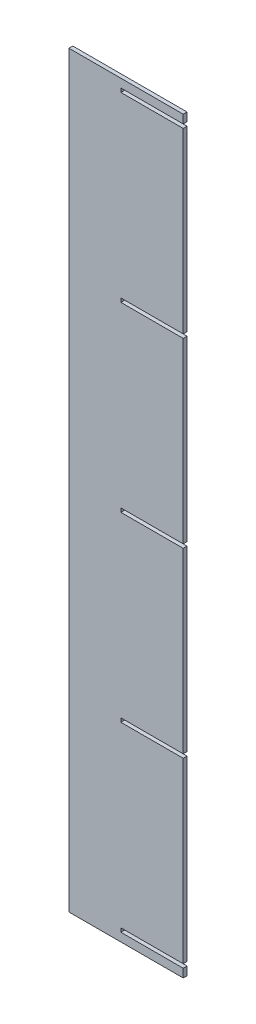
ISO-10303-21;
HEADER;
FILE_DESCRIPTION(('STEP AP214'),'2;1');
FILE_NAME('part.step','',(''),(''),'','','');
FILE_SCHEMA(('AUTOMOTIVE_DESIGN { 1 0 10303 214 1 1 1 1 }'));
ENDSEC;
DATA;
#1=APPLICATION_CONTEXT('core data for automotive mechanical design processes');
#2=APPLICATION_PROTOCOL_DEFINITION('international standard','automotive_design',2000,#1);
#3=PRODUCT_CONTEXT('',#1,'mechanical');
#4=PRODUCT('Part','Part','',(#3));
#5=PRODUCT_RELATED_PRODUCT_CATEGORY('part','',(#4));
#6=PRODUCT_DEFINITION_FORMATION('','',#4);
#7=PRODUCT_DEFINITION_CONTEXT('part definition',#1,'design');
#8=PRODUCT_DEFINITION('design','',#6,#7);
#9=PRODUCT_DEFINITION_SHAPE('','',#8);
#10=(LENGTH_UNIT() NAMED_UNIT(*) SI_UNIT(.MILLI.,.METRE.));
#11=(NAMED_UNIT(*) PLANE_ANGLE_UNIT() SI_UNIT($,.RADIAN.));
#12=(NAMED_UNIT(*) SI_UNIT($,.STERADIAN.) SOLID_ANGLE_UNIT());
#13=UNCERTAINTY_MEASURE_WITH_UNIT(LENGTH_MEASURE(1.E-05),#10,'distance_accuracy_value','');
#14=(GEOMETRIC_REPRESENTATION_CONTEXT(3) GLOBAL_UNCERTAINTY_ASSIGNED_CONTEXT((#13)) GLOBAL_UNIT_ASSIGNED_CONTEXT((#10,
#11,#12)) REPRESENTATION_CONTEXT('',''));
#15=CARTESIAN_POINT('',(0.,0.,0.));
#16=DIRECTION('',(0.,0.,1.));
#17=DIRECTION('',(1.,0.,0.));
#18=AXIS2_PLACEMENT_3D('',#15,#16,#17);
#19=CARTESIAN_POINT('',(25593.6209332168,0.,9.398));
#20=DIRECTION('',(1.,0.,0.));
#21=DIRECTION('',(0.,0.,-1.));
#22=AXIS2_PLACEMENT_3D('',#19,#20,#21);
#23=PLANE('',#22);
#24=DIRECTION('',(0.,-1.,0.));
#25=VECTOR('',#24,1.);
#26=CARTESIAN_POINT('',(25593.6209332168,0.,0.));
#27=LINE('',#26,#25);
#28=CARTESIAN_POINT('',(25593.6209332168,7030.05057188492,0.));
#29=VERTEX_POINT('',#28);
#30=CARTESIAN_POINT('',(25593.6209332168,7020.65257188492,0.));
#31=VERTEX_POINT('',#30);
#32=EDGE_CURVE('E284',#29,#31,#27,.T.);
#33=ORIENTED_EDGE('',*,*,#32,.F.);
#34=DIRECTION('',(0.,0.,-1.));
#35=VECTOR('',#34,1.);
#36=CARTESIAN_POINT('',(25593.6209332168,7030.05057188492,9.398));
#37=LINE('',#36,#35);
#38=CARTESIAN_POINT('',(25593.6209332168,7030.05057188492,9.398));
#39=VERTEX_POINT('',#38);
#40=EDGE_CURVE('E11',#39,#29,#37,.T.);
#41=ORIENTED_EDGE('',*,*,#40,.F.);
#42=DIRECTION('',(0.,-1.,0.));
#43=VECTOR('',#42,1.);
#44=CARTESIAN_POINT('',(25593.6209332168,0.,9.398));
#45=LINE('',#44,#43);
#46=CARTESIAN_POINT('',(25593.6209332168,7020.65257188492,9.398));
#47=VERTEX_POINT('',#46);
#48=EDGE_CURVE('E239',#39,#47,#45,.T.);
#49=ORIENTED_EDGE('',*,*,#48,.T.);
#50=DIRECTION('',(0.,0.,-1.));
#51=VECTOR('',#50,1.);
#52=CARTESIAN_POINT('',(25593.6209332168,7020.65257188492,9.398));
#53=LINE('',#52,#51);
#54=EDGE_CURVE('E51',#47,#31,#53,.T.);
#55=ORIENTED_EDGE('',*,*,#54,.T.);
#56=EDGE_LOOP('',(#33,#41,#49,#55));
#57=FACE_BOUND('',#56,.T.);
#58=ADVANCED_FACE('F35',(#57),#23,.T.);
#59=CARTESIAN_POINT('',(0.,7030.05057188492,9.398));
#60=DIRECTION('',(0.,-1.,0.));
#61=DIRECTION('',(0.,0.,-1.));
#62=AXIS2_PLACEMENT_3D('',#59,#60,#61);
#63=PLANE('',#62);
#64=DIRECTION('',(-1.,0.,0.));
#65=VECTOR('',#64,1.);
#66=CARTESIAN_POINT('',(0.,7030.05057188492,0.));
#67=LINE('',#66,#65);
#68=CARTESIAN_POINT('',(25746.0209332168,7030.05057188492,0.));
#69=VERTEX_POINT('',#68);
#70=EDGE_CURVE('E286',#69,#29,#67,.T.);
#71=ORIENTED_EDGE('',*,*,#70,.F.);
#72=DIRECTION('',(0.,0.,-1.));
#73=VECTOR('',#72,1.);
#74=CARTESIAN_POINT('',(25746.0209332168,7030.05057188492,9.398));
#75=LINE('',#74,#73);
#76=CARTESIAN_POINT('',(25746.0209332168,7030.05057188492,9.398));
#77=VERTEX_POINT('',#76);
#78=EDGE_CURVE('E43',#77,#69,#75,.T.);
#79=ORIENTED_EDGE('',*,*,#78,.F.);
#80=DIRECTION('',(-1.,0.,0.));
#81=VECTOR('',#80,1.);
#82=CARTESIAN_POINT('',(0.,7030.05057188492,9.398));
#83=LINE('',#82,#81);
#84=EDGE_CURVE('E230',#77,#39,#83,.T.);
#85=ORIENTED_EDGE('',*,*,#84,.T.);
#86=ORIENTED_EDGE('',*,*,#40,.T.);
#87=EDGE_LOOP('',(#71,#79,#85,#86));
#88=FACE_BOUND('',#87,.T.);
#89=ADVANCED_FACE('F389',(#88),#63,.T.);
#90=CARTESIAN_POINT('',(25746.0209332168,0.,9.398));
#91=DIRECTION('',(-1.,0.,0.));
#92=DIRECTION('',(0.,0.,1.));
#93=AXIS2_PLACEMENT_3D('',#90,#91,#92);
#94=PLANE('',#93);
#95=DIRECTION('',(0.,1.,0.));
#96=VECTOR('',#95,1.);
#97=CARTESIAN_POINT('',(25746.0209332168,0.,0.));
#98=LINE('',#97,#96);
#99=CARTESIAN_POINT('',(25746.0209332168,7465.15257188492,0.));
#100=VERTEX_POINT('',#99);
#101=EDGE_CURVE('E289',#69,#100,#98,.T.);
#102=ORIENTED_EDGE('',*,*,#101,.T.);
#103=DIRECTION('',(0.,0.,-1.));
#104=VECTOR('',#103,1.);
#105=CARTESIAN_POINT('',(25746.0209332168,7465.15257188492,9.398));
#106=LINE('',#105,#104);
#107=CARTESIAN_POINT('',(25746.0209332168,7465.15257188492,9.398));
#108=VERTEX_POINT('',#107);
#109=EDGE_CURVE('E380',#108,#100,#106,.T.);
#110=ORIENTED_EDGE('',*,*,#109,.F.);
#111=DIRECTION('',(0.,1.,0.));
#112=VECTOR('',#111,1.);
#113=CARTESIAN_POINT('',(25746.0209332168,0.,9.398));
#114=LINE('',#113,#112);
#115=EDGE_CURVE('E222',#77,#108,#114,.T.);
#116=ORIENTED_EDGE('',*,*,#115,.F.);
#117=ORIENTED_EDGE('',*,*,#78,.T.);
#118=EDGE_LOOP('',(#102,#110,#116,#117));
#119=FACE_BOUND('',#118,.T.);
#120=ADVANCED_FACE('F383',(#119),#94,.F.);
#121=CARTESIAN_POINT('',(0.,7465.15257188492,9.398));
#122=DIRECTION('',(0.,1.,0.));
#123=DIRECTION('',(0.,0.,1.));
#124=AXIS2_PLACEMENT_3D('',#121,#122,#123);
#125=PLANE('',#124);
#126=DIRECTION('',(1.,0.,0.));
#127=VECTOR('',#126,1.);
#128=CARTESIAN_POINT('',(0.,7465.15257188492,0.));
#129=LINE('',#128,#127);
#130=CARTESIAN_POINT('',(25593.6209332168,7465.15257188492,0.));
#131=VERTEX_POINT('',#130);
#132=EDGE_CURVE('E292',#131,#100,#129,.T.);
#133=ORIENTED_EDGE('',*,*,#132,.F.);
#134=DIRECTION('',(0.,0.,-1.));
#135=VECTOR('',#134,1.);
#136=CARTESIAN_POINT('',(25593.6209332168,7465.15257188492,9.398));
#137=LINE('',#136,#135);
#138=CARTESIAN_POINT('',(25593.6209332168,7465.15257188492,9.398));
#139=VERTEX_POINT('',#138);
#140=EDGE_CURVE('E378',#139,#131,#137,.T.);
#141=ORIENTED_EDGE('',*,*,#140,.F.);
#142=DIRECTION('',(1.,0.,0.));
#143=VECTOR('',#142,1.);
#144=CARTESIAN_POINT('',(0.,7465.15257188492,9.398));
#145=LINE('',#144,#143);
#146=EDGE_CURVE('E229',#139,#108,#145,.T.);
#147=ORIENTED_EDGE('',*,*,#146,.T.);
#148=ORIENTED_EDGE('',*,*,#109,.T.);
#149=EDGE_LOOP('',(#133,#141,#147,#148));
#150=FACE_BOUND('',#149,.T.);
#151=ADVANCED_FACE('F408',(#150),#125,.T.);
#152=CARTESIAN_POINT('',(25593.6209332168,0.,9.398));
#153=DIRECTION('',(1.,0.,0.));
#154=DIRECTION('',(0.,0.,-1.));
#155=AXIS2_PLACEMENT_3D('',#152,#153,#154);
#156=PLANE('',#155);
#157=DIRECTION('',(0.,-1.,0.));
#158=VECTOR('',#157,1.);
#159=CARTESIAN_POINT('',(25593.6209332168,0.,0.));
#160=LINE('',#159,#158);
#161=CARTESIAN_POINT('',(25593.6209332168,7474.55057188492,0.));
#162=VERTEX_POINT('',#161);
#163=EDGE_CURVE('E297',#162,#131,#160,.T.);
#164=ORIENTED_EDGE('',*,*,#163,.F.);
#165=DIRECTION('',(0.,0.,-1.));
#166=VECTOR('',#165,1.);
#167=CARTESIAN_POINT('',(25593.6209332168,7474.55057188492,9.398));
#168=LINE('',#167,#166);
#169=CARTESIAN_POINT('',(25593.6209332168,7474.55057188492,9.398));
#170=VERTEX_POINT('',#169);
#171=EDGE_CURVE('E376',#170,#162,#168,.T.);
#172=ORIENTED_EDGE('',*,*,#171,.F.);
#173=DIRECTION('',(0.,-1.,0.));
#174=VECTOR('',#173,1.);
#175=CARTESIAN_POINT('',(25593.6209332168,0.,9.398));
#176=LINE('',#175,#174);
#177=EDGE_CURVE('E237',#170,#139,#176,.T.);
#178=ORIENTED_EDGE('',*,*,#177,.T.);
#179=ORIENTED_EDGE('',*,*,#140,.T.);
#180=EDGE_LOOP('',(#164,#172,#178,#179));
#181=FACE_BOUND('',#180,.T.);
#182=ADVANCED_FACE('F413',(#181),#156,.T.);
#183=CARTESIAN_POINT('',(0.,7474.55057188492,9.398));
#184=DIRECTION('',(0.,-1.,0.));
#185=DIRECTION('',(0.,0.,-1.));
#186=AXIS2_PLACEMENT_3D('',#183,#184,#185);
#187=PLANE('',#186);
#188=DIRECTION('',(-1.,0.,0.));
#189=VECTOR('',#188,1.);
#190=CARTESIAN_POINT('',(0.,7474.55057188492,0.));
#191=LINE('',#190,#189);
#192=CARTESIAN_POINT('',(25746.0209332168,7474.55057188492,0.));
#193=VERTEX_POINT('',#192);
#194=EDGE_CURVE('E300',#193,#162,#191,.T.);
#195=ORIENTED_EDGE('',*,*,#194,.F.);
#196=DIRECTION('',(0.,0.,-1.));
#197=VECTOR('',#196,1.);
#198=CARTESIAN_POINT('',(25746.0209332168,7474.55057188492,9.398));
#199=LINE('',#198,#197);
#200=CARTESIAN_POINT('',(25746.0209332168,7474.55057188492,9.398));
#201=VERTEX_POINT('',#200);
#202=EDGE_CURVE('E374',#201,#193,#199,.T.);
#203=ORIENTED_EDGE('',*,*,#202,.F.);
#204=DIRECTION('',(-1.,0.,0.));
#205=VECTOR('',#204,1.);
#206=CARTESIAN_POINT('',(0.,7474.55057188492,9.398));
#207=LINE('',#206,#205);
#208=EDGE_CURVE('E241',#201,#170,#207,.T.);
#209=ORIENTED_EDGE('',*,*,#208,.T.);
#210=ORIENTED_EDGE('',*,*,#171,.T.);
#211=EDGE_LOOP('',(#195,#203,#209,#210));
#212=FACE_BOUND('',#211,.T.);
#213=ADVANCED_FACE('F417',(#212),#187,.T.);
#214=CARTESIAN_POINT('',(25746.0209332168,7909.65257188492,0.));
#215=VERTEX_POINT('',#214);
#216=EDGE_CURVE('E294',#193,#215,#98,.T.);
#217=ORIENTED_EDGE('',*,*,#216,.T.);
#218=DIRECTION('',(0.,0.,-1.));
#219=VECTOR('',#218,1.);
#220=CARTESIAN_POINT('',(25746.0209332168,7909.65257188492,9.398));
#221=LINE('',#220,#219);
#222=CARTESIAN_POINT('',(25746.0209332168,7909.65257188492,9.398));
#223=VERTEX_POINT('',#222);
#224=EDGE_CURVE('E372',#223,#215,#221,.T.);
#225=ORIENTED_EDGE('',*,*,#224,.F.);
#226=EDGE_CURVE('E231',#201,#223,#114,.T.);
#227=ORIENTED_EDGE('',*,*,#226,.F.);
#228=ORIENTED_EDGE('',*,*,#202,.T.);
#229=EDGE_LOOP('',(#217,#225,#227,#228));
#230=FACE_BOUND('',#229,.T.);
#231=ADVANCED_FACE('F409',(#230),#94,.F.);
#232=CARTESIAN_POINT('',(0.,7909.65257188492,9.398));
#233=DIRECTION('',(0.,1.,0.));
#234=DIRECTION('',(0.,0.,1.));
#235=AXIS2_PLACEMENT_3D('',#232,#233,#234);
#236=PLANE('',#235);
#237=DIRECTION('',(1.,0.,0.));
#238=VECTOR('',#237,1.);
#239=CARTESIAN_POINT('',(0.,7909.65257188492,0.));
#240=LINE('',#239,#238);
#241=CARTESIAN_POINT('',(25593.6209332168,7909.65257188492,0.));
#242=VERTEX_POINT('',#241);
#243=EDGE_CURVE('E303',#242,#215,#240,.T.);
#244=ORIENTED_EDGE('',*,*,#243,.F.);
#245=DIRECTION('',(0.,0.,-1.));
#246=VECTOR('',#245,1.);
#247=CARTESIAN_POINT('',(25593.6209332168,7909.65257188492,9.398));
#248=LINE('',#247,#246);
#249=CARTESIAN_POINT('',(25593.6209332168,7909.65257188492,9.398));
#250=VERTEX_POINT('',#249);
#251=EDGE_CURVE('E370',#250,#242,#248,.T.);
#252=ORIENTED_EDGE('',*,*,#251,.F.);
#253=DIRECTION('',(1.,0.,0.));
#254=VECTOR('',#253,1.);
#255=CARTESIAN_POINT('',(0.,7909.65257188492,9.398));
#256=LINE('',#255,#254);
#257=EDGE_CURVE('E240',#250,#223,#256,.T.);
#258=ORIENTED_EDGE('',*,*,#257,.T.);
#259=ORIENTED_EDGE('',*,*,#224,.T.);
#260=EDGE_LOOP('',(#244,#252,#258,#259));
#261=FACE_BOUND('',#260,.T.);
#262=ADVANCED_FACE('F422',(#261),#236,.T.);
#263=CARTESIAN_POINT('',(25593.6209332168,0.,9.398));
#264=DIRECTION('',(1.,0.,0.));
#265=DIRECTION('',(0.,0.,-1.));
#266=AXIS2_PLACEMENT_3D('',#263,#264,#265);
#267=PLANE('',#266);
#268=DIRECTION('',(0.,-1.,0.));
#269=VECTOR('',#268,1.);
#270=CARTESIAN_POINT('',(25593.6209332168,0.,0.));
#271=LINE('',#270,#269);
#272=CARTESIAN_POINT('',(25593.6209332168,7919.05057188492,0.));
#273=VERTEX_POINT('',#272);
#274=EDGE_CURVE('E306',#273,#242,#271,.T.);
#275=ORIENTED_EDGE('',*,*,#274,.F.);
#276=DIRECTION('',(0.,0.,-1.));
#277=VECTOR('',#276,1.);
#278=CARTESIAN_POINT('',(25593.6209332168,7919.05057188492,9.398));
#279=LINE('',#278,#277);
#280=CARTESIAN_POINT('',(25593.6209332168,7919.05057188492,9.398));
#281=VERTEX_POINT('',#280);
#282=EDGE_CURVE('E368',#281,#273,#279,.T.);
#283=ORIENTED_EDGE('',*,*,#282,.F.);
#284=DIRECTION('',(0.,-1.,0.));
#285=VECTOR('',#284,1.);
#286=CARTESIAN_POINT('',(25593.6209332168,0.,9.398));
#287=LINE('',#286,#285);
#288=EDGE_CURVE('E248',#281,#250,#287,.T.);
#289=ORIENTED_EDGE('',*,*,#288,.T.);
#290=ORIENTED_EDGE('',*,*,#251,.T.);
#291=EDGE_LOOP('',(#275,#283,#289,#290));
#292=FACE_BOUND('',#291,.T.);
#293=ADVANCED_FACE('F425',(#292),#267,.T.);
#294=CARTESIAN_POINT('',(0.,7919.05057188492,9.398));
#295=DIRECTION('',(0.,-1.,0.));
#296=DIRECTION('',(0.,0.,-1.));
#297=AXIS2_PLACEMENT_3D('',#294,#295,#296);
#298=PLANE('',#297);
#299=DIRECTION('',(-1.,0.,0.));
#300=VECTOR('',#299,1.);
#301=CARTESIAN_POINT('',(0.,7919.05057188492,0.));
#302=LINE('',#301,#300);
#303=CARTESIAN_POINT('',(25746.0209332168,7919.05057188492,0.));
#304=VERTEX_POINT('',#303);
#305=EDGE_CURVE('E309',#304,#273,#302,.T.);
#306=ORIENTED_EDGE('',*,*,#305,.F.);
#307=DIRECTION('',(0.,0.,-1.));
#308=VECTOR('',#307,1.);
#309=CARTESIAN_POINT('',(25746.0209332168,7919.05057188492,9.398));
#310=LINE('',#309,#308);
#311=CARTESIAN_POINT('',(25746.0209332168,7919.05057188492,9.398));
#312=VERTEX_POINT('',#311);
#313=EDGE_CURVE('E366',#312,#304,#310,.T.);
#314=ORIENTED_EDGE('',*,*,#313,.F.);
#315=DIRECTION('',(-1.,0.,0.));
#316=VECTOR('',#315,1.);
#317=CARTESIAN_POINT('',(0.,7919.05057188492,9.398));
#318=LINE('',#317,#316);
#319=EDGE_CURVE('E253',#312,#281,#318,.T.);
#320=ORIENTED_EDGE('',*,*,#319,.T.);
#321=ORIENTED_EDGE('',*,*,#282,.T.);
#322=EDGE_LOOP('',(#306,#314,#320,#321));
#323=FACE_BOUND('',#322,.T.);
#324=ADVANCED_FACE('F429',(#323),#298,.T.);
#325=CARTESIAN_POINT('',(25746.0209332168,8354.15257188492,0.));
#326=VERTEX_POINT('',#325);
#327=EDGE_CURVE('E312',#304,#326,#98,.T.);
#328=ORIENTED_EDGE('',*,*,#327,.T.);
#329=DIRECTION('',(0.,0.,-1.));
#330=VECTOR('',#329,1.);
#331=CARTESIAN_POINT('',(25746.0209332168,8354.15257188492,9.398));
#332=LINE('',#331,#330);
#333=CARTESIAN_POINT('',(25746.0209332168,8354.15257188492,9.398));
#334=VERTEX_POINT('',#333);
#335=EDGE_CURVE('E364',#334,#326,#332,.T.);
#336=ORIENTED_EDGE('',*,*,#335,.F.);
#337=EDGE_CURVE('E242',#312,#334,#114,.T.);
#338=ORIENTED_EDGE('',*,*,#337,.F.);
#339=ORIENTED_EDGE('',*,*,#313,.T.);
#340=EDGE_LOOP('',(#328,#336,#338,#339));
#341=FACE_BOUND('',#340,.T.);
#342=ADVANCED_FACE('F433',(#341),#94,.F.);
#343=CARTESIAN_POINT('',(0.,8354.15257188492,9.398));
#344=DIRECTION('',(0.,1.,0.));
#345=DIRECTION('',(0.,0.,1.));
#346=AXIS2_PLACEMENT_3D('',#343,#344,#345);
#347=PLANE('',#346);
#348=DIRECTION('',(1.,0.,0.));
#349=VECTOR('',#348,1.);
#350=CARTESIAN_POINT('',(0.,8354.15257188492,0.));
#351=LINE('',#350,#349);
#352=CARTESIAN_POINT('',(25593.6209332168,8354.15257188492,0.));
#353=VERTEX_POINT('',#352);
#354=EDGE_CURVE('E313',#353,#326,#351,.T.);
#355=ORIENTED_EDGE('',*,*,#354,.F.);
#356=DIRECTION('',(0.,0.,-1.));
#357=VECTOR('',#356,1.);
#358=CARTESIAN_POINT('',(25593.6209332168,8354.15257188492,9.398));
#359=LINE('',#358,#357);
#360=CARTESIAN_POINT('',(25593.6209332168,8354.15257188492,9.398));
#361=VERTEX_POINT('',#360);
#362=EDGE_CURVE('E362',#361,#353,#359,.T.);
#363=ORIENTED_EDGE('',*,*,#362,.F.);
#364=DIRECTION('',(1.,0.,0.));
#365=VECTOR('',#364,1.);
#366=CARTESIAN_POINT('',(0.,8354.15257188492,9.398));
#367=LINE('',#366,#365);
#368=EDGE_CURVE('E252',#361,#334,#367,.T.);
#369=ORIENTED_EDGE('',*,*,#368,.T.);
#370=ORIENTED_EDGE('',*,*,#335,.T.);
#371=EDGE_LOOP('',(#355,#363,#369,#370));
#372=FACE_BOUND('',#371,.T.);
#373=ADVANCED_FACE('F435',(#372),#347,.T.);
#374=CARTESIAN_POINT('',(25593.6209332168,0.,9.398));
#375=DIRECTION('',(1.,0.,0.));
#376=DIRECTION('',(0.,0.,-1.));
#377=AXIS2_PLACEMENT_3D('',#374,#375,#376);
#378=PLANE('',#377);
#379=DIRECTION('',(0.,-1.,0.));
#380=VECTOR('',#379,1.);
#381=CARTESIAN_POINT('',(25593.6209332168,0.,0.));
#382=LINE('',#381,#380);
#383=CARTESIAN_POINT('',(25593.6209332168,8363.55057188492,0.));
#384=VERTEX_POINT('',#383);
#385=EDGE_CURVE('E316',#384,#353,#382,.T.);
#386=ORIENTED_EDGE('',*,*,#385,.F.);
#387=DIRECTION('',(0.,0.,-1.));
#388=VECTOR('',#387,1.);
#389=CARTESIAN_POINT('',(25593.6209332168,8363.55057188492,9.398));
#390=LINE('',#389,#388);
#391=CARTESIAN_POINT('',(25593.6209332168,8363.55057188492,9.398));
#392=VERTEX_POINT('',#391);
#393=EDGE_CURVE('E360',#392,#384,#390,.T.);
#394=ORIENTED_EDGE('',*,*,#393,.F.);
#395=DIRECTION('',(0.,-1.,0.));
#396=VECTOR('',#395,1.);
#397=CARTESIAN_POINT('',(25593.6209332168,0.,9.398));
#398=LINE('',#397,#396);
#399=EDGE_CURVE('E259',#392,#361,#398,.T.);
#400=ORIENTED_EDGE('',*,*,#399,.T.);
#401=ORIENTED_EDGE('',*,*,#362,.T.);
#402=EDGE_LOOP('',(#386,#394,#400,#401));
#403=FACE_BOUND('',#402,.T.);
#404=ADVANCED_FACE('F438',(#403),#378,.T.);
#405=CARTESIAN_POINT('',(0.,8363.55057188492,9.398));
#406=DIRECTION('',(0.,-1.,0.));
#407=DIRECTION('',(0.,0.,-1.));
#408=AXIS2_PLACEMENT_3D('',#405,#406,#407);
#409=PLANE('',#408);
#410=DIRECTION('',(-1.,0.,0.));
#411=VECTOR('',#410,1.);
#412=CARTESIAN_POINT('',(0.,8363.55057188492,0.));
#413=LINE('',#412,#411);
#414=CARTESIAN_POINT('',(25746.0209332168,8363.55057188492,0.));
#415=VERTEX_POINT('',#414);
#416=EDGE_CURVE('E319',#415,#384,#413,.T.);
#417=ORIENTED_EDGE('',*,*,#416,.F.);
#418=DIRECTION('',(0.,0.,-1.));
#419=VECTOR('',#418,1.);
#420=CARTESIAN_POINT('',(25746.0209332168,8363.55057188492,9.398));
#421=LINE('',#420,#419);
#422=CARTESIAN_POINT('',(25746.0209332168,8363.55057188492,9.398));
#423=VERTEX_POINT('',#422);
#424=EDGE_CURVE('E358',#423,#415,#421,.T.);
#425=ORIENTED_EDGE('',*,*,#424,.F.);
#426=DIRECTION('',(-1.,0.,0.));
#427=VECTOR('',#426,1.);
#428=CARTESIAN_POINT('',(0.,8363.55057188492,9.398));
#429=LINE('',#428,#427);
#430=EDGE_CURVE('E264',#423,#392,#429,.T.);
#431=ORIENTED_EDGE('',*,*,#430,.T.);
#432=ORIENTED_EDGE('',*,*,#393,.T.);
#433=EDGE_LOOP('',(#417,#425,#431,#432));
#434=FACE_BOUND('',#433,.T.);
#435=ADVANCED_FACE('F442',(#434),#409,.T.);
#436=CARTESIAN_POINT('',(25746.0209332168,8798.65257188492,0.));
#437=VERTEX_POINT('',#436);
#438=EDGE_CURVE('E322',#415,#437,#98,.T.);
#439=ORIENTED_EDGE('',*,*,#438,.T.);
#440=DIRECTION('',(0.,0.,-1.));
#441=VECTOR('',#440,1.);
#442=CARTESIAN_POINT('',(25746.0209332168,8798.65257188492,9.398));
#443=LINE('',#442,#441);
#444=CARTESIAN_POINT('',(25746.0209332168,8798.65257188492,9.398));
#445=VERTEX_POINT('',#444);
#446=EDGE_CURVE('E356',#445,#437,#443,.T.);
#447=ORIENTED_EDGE('',*,*,#446,.F.);
#448=EDGE_CURVE('E228',#423,#445,#114,.T.);
#449=ORIENTED_EDGE('',*,*,#448,.F.);
#450=ORIENTED_EDGE('',*,*,#424,.T.);
#451=EDGE_LOOP('',(#439,#447,#449,#450));
#452=FACE_BOUND('',#451,.T.);
#453=ADVANCED_FACE('F446',(#452),#94,.F.);
#454=CARTESIAN_POINT('',(0.,8798.65257188492,9.398));
#455=DIRECTION('',(0.,1.,0.));
#456=DIRECTION('',(0.,0.,1.));
#457=AXIS2_PLACEMENT_3D('',#454,#455,#456);
#458=PLANE('',#457);
#459=DIRECTION('',(1.,0.,0.));
#460=VECTOR('',#459,1.);
#461=CARTESIAN_POINT('',(0.,8798.65257188492,0.));
#462=LINE('',#461,#460);
#463=CARTESIAN_POINT('',(25593.6209332168,8798.65257188492,0.));
#464=VERTEX_POINT('',#463);
#465=EDGE_CURVE('E323',#464,#437,#462,.T.);
#466=ORIENTED_EDGE('',*,*,#465,.F.);
#467=DIRECTION('',(0.,0.,-1.));
#468=VECTOR('',#467,1.);
#469=CARTESIAN_POINT('',(25593.6209332168,8798.65257188492,9.398));
#470=LINE('',#469,#468);
#471=CARTESIAN_POINT('',(25593.6209332168,8798.65257188492,9.398));
#472=VERTEX_POINT('',#471);
#473=EDGE_CURVE('E354',#472,#464,#470,.T.);
#474=ORIENTED_EDGE('',*,*,#473,.F.);
#475=DIRECTION('',(1.,0.,0.));
#476=VECTOR('',#475,1.);
#477=CARTESIAN_POINT('',(0.,8798.65257188492,9.398));
#478=LINE('',#477,#476);
#479=EDGE_CURVE('E263',#472,#445,#478,.T.);
#480=ORIENTED_EDGE('',*,*,#479,.T.);
#481=ORIENTED_EDGE('',*,*,#446,.T.);
#482=EDGE_LOOP('',(#466,#474,#480,#481));
#483=FACE_BOUND('',#482,.T.);
#484=ADVANCED_FACE('F447',(#483),#458,.T.);
#485=CARTESIAN_POINT('',(25593.6209332168,0.,9.398));
#486=DIRECTION('',(1.,0.,0.));
#487=DIRECTION('',(0.,0.,-1.));
#488=AXIS2_PLACEMENT_3D('',#485,#486,#487);
#489=PLANE('',#488);
#490=DIRECTION('',(0.,-1.,0.));
#491=VECTOR('',#490,1.);
#492=CARTESIAN_POINT('',(25593.6209332168,0.,0.));
#493=LINE('',#492,#491);
#494=CARTESIAN_POINT('',(25593.6209332168,8808.05057188492,0.));
#495=VERTEX_POINT('',#494);
#496=EDGE_CURVE('E326',#495,#464,#493,.T.);
#497=ORIENTED_EDGE('',*,*,#496,.F.);
#498=DIRECTION('',(0.,0.,-1.));
#499=VECTOR('',#498,1.);
#500=CARTESIAN_POINT('',(25593.6209332168,8808.05057188492,9.398));
#501=LINE('',#500,#499);
#502=CARTESIAN_POINT('',(25593.6209332168,8808.05057188492,9.398));
#503=VERTEX_POINT('',#502);
#504=EDGE_CURVE('E352',#503,#495,#501,.T.);
#505=ORIENTED_EDGE('',*,*,#504,.F.);
#506=DIRECTION('',(0.,-1.,0.));
#507=VECTOR('',#506,1.);
#508=CARTESIAN_POINT('',(25593.6209332168,0.,9.398));
#509=LINE('',#508,#507);
#510=EDGE_CURVE('E270',#503,#472,#509,.T.);
#511=ORIENTED_EDGE('',*,*,#510,.T.);
#512=ORIENTED_EDGE('',*,*,#473,.T.);
#513=EDGE_LOOP('',(#497,#505,#511,#512));
#514=FACE_BOUND('',#513,.T.);
#515=ADVANCED_FACE('F450',(#514),#489,.T.);
#516=CARTESIAN_POINT('',(0.,8808.05057188492,9.398));
#517=DIRECTION('',(0.,-1.,0.));
#518=DIRECTION('',(0.,0.,-1.));
#519=AXIS2_PLACEMENT_3D('',#516,#517,#518);
#520=PLANE('',#519);
#521=DIRECTION('',(-1.,0.,0.));
#522=VECTOR('',#521,1.);
#523=CARTESIAN_POINT('',(0.,8808.05057188492,0.));
#524=LINE('',#523,#522);
#525=CARTESIAN_POINT('',(25746.0209332168,8808.05057188492,0.));
#526=VERTEX_POINT('',#525);
#527=EDGE_CURVE('E329',#526,#495,#524,.T.);
#528=ORIENTED_EDGE('',*,*,#527,.F.);
#529=DIRECTION('',(0.,0.,-1.));
#530=VECTOR('',#529,1.);
#531=CARTESIAN_POINT('',(25746.0209332168,8808.05057188492,9.398));
#532=LINE('',#531,#530);
#533=CARTESIAN_POINT('',(25746.0209332168,8808.05057188492,9.398));
#534=VERTEX_POINT('',#533);
#535=EDGE_CURVE('E350',#534,#526,#532,.T.);
#536=ORIENTED_EDGE('',*,*,#535,.F.);
#537=DIRECTION('',(-1.,0.,0.));
#538=VECTOR('',#537,1.);
#539=CARTESIAN_POINT('',(0.,8808.05057188492,9.398));
#540=LINE('',#539,#538);
#541=EDGE_CURVE('E227',#534,#503,#540,.T.);
#542=ORIENTED_EDGE('',*,*,#541,.T.);
#543=ORIENTED_EDGE('',*,*,#504,.T.);
#544=EDGE_LOOP('',(#528,#536,#542,#543));
#545=FACE_BOUND('',#544,.T.);
#546=ADVANCED_FACE('F454',(#545),#520,.T.);
#547=CARTESIAN_POINT('',(25746.0209332168,8828.75157188492,0.));
#548=VERTEX_POINT('',#547);
#549=EDGE_CURVE('E332',#526,#548,#98,.T.);
#550=ORIENTED_EDGE('',*,*,#549,.T.);
#551=DIRECTION('',(0.,0.,-1.));
#552=VECTOR('',#551,1.);
#553=CARTESIAN_POINT('',(25746.0209332168,8828.75157188492,9.398));
#554=LINE('',#553,#552);
#555=CARTESIAN_POINT('',(25746.0209332168,8828.75157188492,9.398));
#556=VERTEX_POINT('',#555);
#557=EDGE_CURVE('E347',#556,#548,#554,.T.);
#558=ORIENTED_EDGE('',*,*,#557,.F.);
#559=EDGE_CURVE('E221',#534,#556,#114,.T.);
#560=ORIENTED_EDGE('',*,*,#559,.F.);
#561=ORIENTED_EDGE('',*,*,#535,.T.);
#562=EDGE_LOOP('',(#550,#558,#560,#561));
#563=FACE_BOUND('',#562,.T.);
#564=ADVANCED_FACE('F399',(#563),#94,.F.);
#565=CARTESIAN_POINT('',(0.,8828.75157188492,9.398));
#566=DIRECTION('',(0.,-1.,0.));
#567=DIRECTION('',(0.,0.,-1.));
#568=AXIS2_PLACEMENT_3D('',#565,#566,#567);
#569=PLANE('',#568);
#570=DIRECTION('',(-1.,0.,0.));
#571=VECTOR('',#570,1.);
#572=CARTESIAN_POINT('',(0.,8828.75157188492,0.));
#573=LINE('',#572,#571);
#574=CARTESIAN_POINT('',(25466.6209332168,8828.75157188492,0.));
#575=VERTEX_POINT('',#574);
#576=EDGE_CURVE('E333',#548,#575,#573,.T.);
#577=ORIENTED_EDGE('',*,*,#576,.T.);
#578=DIRECTION('',(0.,0.,-1.));
#579=VECTOR('',#578,1.);
#580=CARTESIAN_POINT('',(25466.6209332168,8828.75157188492,9.398));
#581=LINE('',#580,#579);
#582=CARTESIAN_POINT('',(25466.6209332168,8828.75157188492,9.398));
#583=VERTEX_POINT('',#582);
#584=EDGE_CURVE('E344',#583,#575,#581,.T.);
#585=ORIENTED_EDGE('',*,*,#584,.F.);
#586=DIRECTION('',(-1.,0.,0.));
#587=VECTOR('',#586,1.);
#588=CARTESIAN_POINT('',(0.,8828.75157188492,9.398));
#589=LINE('',#588,#587);
#590=EDGE_CURVE('E226',#556,#583,#589,.T.);
#591=ORIENTED_EDGE('',*,*,#590,.F.);
#592=ORIENTED_EDGE('',*,*,#557,.T.);
#593=EDGE_LOOP('',(#577,#585,#591,#592));
#594=FACE_BOUND('',#593,.T.);
#595=ADVANCED_FACE('F459',(#594),#569,.F.);
#596=CARTESIAN_POINT('',(25466.6209332168,0.,9.398));
#597=DIRECTION('',(1.,0.,0.));
#598=DIRECTION('',(0.,0.,-1.));
#599=AXIS2_PLACEMENT_3D('',#596,#597,#598);
#600=PLANE('',#599);
#601=DIRECTION('',(0.,-1.,0.));
#602=VECTOR('',#601,1.);
#603=CARTESIAN_POINT('',(25466.6209332168,0.,0.));
#604=LINE('',#603,#602);
#605=CARTESIAN_POINT('',(25466.6209332168,6999.95157188492,0.));
#606=VERTEX_POINT('',#605);
#607=EDGE_CURVE('E335',#575,#606,#604,.T.);
#608=ORIENTED_EDGE('',*,*,#607,.T.);
#609=DIRECTION('',(0.,0.,-1.));
#610=VECTOR('',#609,1.);
#611=CARTESIAN_POINT('',(25466.6209332168,6999.95157188492,9.398));
#612=LINE('',#611,#610);
#613=CARTESIAN_POINT('',(25466.6209332168,6999.95157188492,9.398));
#614=VERTEX_POINT('',#613);
#615=EDGE_CURVE('E216',#614,#606,#612,.T.);
#616=ORIENTED_EDGE('',*,*,#615,.F.);
#617=DIRECTION('',(0.,-1.,0.));
#618=VECTOR('',#617,1.);
#619=CARTESIAN_POINT('',(25466.6209332168,0.,9.398));
#620=LINE('',#619,#618);
#621=EDGE_CURVE('E204',#583,#614,#620,.T.);
#622=ORIENTED_EDGE('',*,*,#621,.F.);
#623=ORIENTED_EDGE('',*,*,#584,.T.);
#624=EDGE_LOOP('',(#608,#616,#622,#623));
#625=FACE_BOUND('',#624,.T.);
#626=ADVANCED_FACE('F462',(#625),#600,.F.);
#627=CARTESIAN_POINT('',(0.,6999.95157188492,9.398));
#628=DIRECTION('',(0.,1.,0.));
#629=DIRECTION('',(0.,0.,1.));
#630=AXIS2_PLACEMENT_3D('',#627,#628,#629);
#631=PLANE('',#630);
#632=DIRECTION('',(1.,0.,0.));
#633=VECTOR('',#632,1.);
#634=CARTESIAN_POINT('',(0.,6999.95157188492,0.));
#635=LINE('',#634,#633);
#636=CARTESIAN_POINT('',(25746.0209332168,6999.95157188492,0.));
#637=VERTEX_POINT('',#636);
#638=EDGE_CURVE('E213',#606,#637,#635,.T.);
#639=ORIENTED_EDGE('',*,*,#638,.T.);
#640=DIRECTION('',(0.,0.,-1.));
#641=VECTOR('',#640,1.);
#642=CARTESIAN_POINT('',(25746.0209332168,6999.95157188492,9.398));
#643=LINE('',#642,#641);
#644=CARTESIAN_POINT('',(25746.0209332168,6999.95157188492,9.398));
#645=VERTEX_POINT('',#644);
#646=EDGE_CURVE('E210',#645,#637,#643,.T.);
#647=ORIENTED_EDGE('',*,*,#646,.F.);
#648=DIRECTION('',(1.,0.,0.));
#649=VECTOR('',#648,1.);
#650=CARTESIAN_POINT('',(0.,6999.95157188492,9.398));
#651=LINE('',#650,#649);
#652=EDGE_CURVE('E197',#614,#645,#651,.T.);
#653=ORIENTED_EDGE('',*,*,#652,.F.);
#654=ORIENTED_EDGE('',*,*,#615,.T.);
#655=EDGE_LOOP('',(#639,#647,#653,#654));
#656=FACE_BOUND('',#655,.T.);
#657=ADVANCED_FACE('F211',(#656),#631,.F.);
#658=CARTESIAN_POINT('',(25746.0209332168,7020.65257188492,0.));
#659=VERTEX_POINT('',#658);
#660=EDGE_CURVE('E293',#637,#659,#98,.T.);
#661=ORIENTED_EDGE('',*,*,#660,.T.);
#662=DIRECTION('',(0.,0.,-1.));
#663=VECTOR('',#662,1.);
#664=CARTESIAN_POINT('',(25746.0209332168,7020.65257188492,9.398));
#665=LINE('',#664,#663);
#666=CARTESIAN_POINT('',(25746.0209332168,7020.65257188492,9.398));
#667=VERTEX_POINT('',#666);
#668=EDGE_CURVE('E125',#667,#659,#665,.T.);
#669=ORIENTED_EDGE('',*,*,#668,.F.);
#670=EDGE_CURVE('E202',#645,#667,#114,.T.);
#671=ORIENTED_EDGE('',*,*,#670,.F.);
#672=ORIENTED_EDGE('',*,*,#646,.T.);
#673=EDGE_LOOP('',(#661,#669,#671,#672));
#674=FACE_BOUND('',#673,.T.);
#675=ADVANCED_FACE('F218',(#674),#94,.F.);
#676=CARTESIAN_POINT('',(0.,7020.65257188492,9.398));
#677=DIRECTION('',(0.,1.,0.));
#678=DIRECTION('',(0.,0.,1.));
#679=AXIS2_PLACEMENT_3D('',#676,#677,#678);
#680=PLANE('',#679);
#681=DIRECTION('',(1.,0.,0.));
#682=VECTOR('',#681,1.);
#683=CARTESIAN_POINT('',(0.,7020.65257188492,0.));
#684=LINE('',#683,#682);
#685=EDGE_CURVE('E338',#31,#659,#684,.T.);
#686=ORIENTED_EDGE('',*,*,#685,.F.);
#687=ORIENTED_EDGE('',*,*,#54,.F.);
#688=DIRECTION('',(1.,0.,0.));
#689=VECTOR('',#688,1.);
#690=CARTESIAN_POINT('',(0.,7020.65257188492,9.398));
#691=LINE('',#690,#689);
#692=EDGE_CURVE('E219',#47,#667,#691,.T.);
#693=ORIENTED_EDGE('',*,*,#692,.T.);
#694=ORIENTED_EDGE('',*,*,#668,.T.);
#695=EDGE_LOOP('',(#686,#687,#693,#694));
#696=FACE_BOUND('',#695,.T.);
#697=ADVANCED_FACE('F390',(#696),#680,.T.);
#698=CARTESIAN_POINT('',(0.,0.,9.398));
#699=DIRECTION('',(0.,0.,1.));
#700=DIRECTION('',(1.,0.,0.));
#701=AXIS2_PLACEMENT_3D('',#698,#699,#700);
#702=PLANE('',#701);
#703=ORIENTED_EDGE('',*,*,#48,.F.);
#704=ORIENTED_EDGE('',*,*,#84,.F.);
#705=ORIENTED_EDGE('',*,*,#115,.T.);
#706=ORIENTED_EDGE('',*,*,#146,.F.);
#707=ORIENTED_EDGE('',*,*,#177,.F.);
#708=ORIENTED_EDGE('',*,*,#208,.F.);
#709=ORIENTED_EDGE('',*,*,#226,.T.);
#710=ORIENTED_EDGE('',*,*,#257,.F.);
#711=ORIENTED_EDGE('',*,*,#288,.F.);
#712=ORIENTED_EDGE('',*,*,#319,.F.);
#713=ORIENTED_EDGE('',*,*,#337,.T.);
#714=ORIENTED_EDGE('',*,*,#368,.F.);
#715=ORIENTED_EDGE('',*,*,#399,.F.);
#716=ORIENTED_EDGE('',*,*,#430,.F.);
#717=ORIENTED_EDGE('',*,*,#448,.T.);
#718=ORIENTED_EDGE('',*,*,#479,.F.);
#719=ORIENTED_EDGE('',*,*,#510,.F.);
#720=ORIENTED_EDGE('',*,*,#541,.F.);
#721=ORIENTED_EDGE('',*,*,#559,.T.);
#722=ORIENTED_EDGE('',*,*,#590,.T.);
#723=ORIENTED_EDGE('',*,*,#621,.T.);
#724=ORIENTED_EDGE('',*,*,#652,.T.);
#725=ORIENTED_EDGE('',*,*,#670,.T.);
#726=ORIENTED_EDGE('',*,*,#692,.F.);
#727=EDGE_LOOP('',(#703,#704,#705,#706,#707,#708,#709,#710,#711,#712,#713,#714,#715,#716,#717,
#718,#719,#720,#721,#722,#723,#724,#725,#726));
#728=FACE_BOUND('',#727,.T.);
#729=ADVANCED_FACE('F199',(#728),#702,.T.);
#730=CARTESIAN_POINT('',(0.,0.,0.));
#731=DIRECTION('',(0.,0.,1.));
#732=DIRECTION('',(1.,0.,0.));
#733=AXIS2_PLACEMENT_3D('',#730,#731,#732);
#734=PLANE('',#733);
#735=ORIENTED_EDGE('',*,*,#32,.T.);
#736=ORIENTED_EDGE('',*,*,#685,.T.);
#737=ORIENTED_EDGE('',*,*,#660,.F.);
#738=ORIENTED_EDGE('',*,*,#638,.F.);
#739=ORIENTED_EDGE('',*,*,#607,.F.);
#740=ORIENTED_EDGE('',*,*,#576,.F.);
#741=ORIENTED_EDGE('',*,*,#549,.F.);
#742=ORIENTED_EDGE('',*,*,#527,.T.);
#743=ORIENTED_EDGE('',*,*,#496,.T.);
#744=ORIENTED_EDGE('',*,*,#465,.T.);
#745=ORIENTED_EDGE('',*,*,#438,.F.);
#746=ORIENTED_EDGE('',*,*,#416,.T.);
#747=ORIENTED_EDGE('',*,*,#385,.T.);
#748=ORIENTED_EDGE('',*,*,#354,.T.);
#749=ORIENTED_EDGE('',*,*,#327,.F.);
#750=ORIENTED_EDGE('',*,*,#305,.T.);
#751=ORIENTED_EDGE('',*,*,#274,.T.);
#752=ORIENTED_EDGE('',*,*,#243,.T.);
#753=ORIENTED_EDGE('',*,*,#216,.F.);
#754=ORIENTED_EDGE('',*,*,#194,.T.);
#755=ORIENTED_EDGE('',*,*,#163,.T.);
#756=ORIENTED_EDGE('',*,*,#132,.T.);
#757=ORIENTED_EDGE('',*,*,#101,.F.);
#758=ORIENTED_EDGE('',*,*,#70,.T.);
#759=EDGE_LOOP('',(#735,#736,#737,#738,#739,#740,#741,#742,#743,#744,#745,#746,#747,#748,#749,
#750,#751,#752,#753,#754,#755,#756,#757,#758));
#760=FACE_BOUND('',#759,.T.);
#761=ADVANCED_FACE('F387',(#760),#734,.F.);
#762=CLOSED_SHELL('',(#58,#89,#120,#151,#182,#213,#231,#262,#293,#324,#342,#373,#404,#435,#453,
#484,#515,#546,#564,#595,#626,#657,#675,#697,#729,#761));
#763=MANIFOLD_SOLID_BREP('B2',#762);
#764=ADVANCED_BREP_SHAPE_REPRESENTATION('',(#18,#763),#14);
#765=SHAPE_DEFINITION_REPRESENTATION(#9,#764);
ENDSEC;
END-ISO-10303-21;
